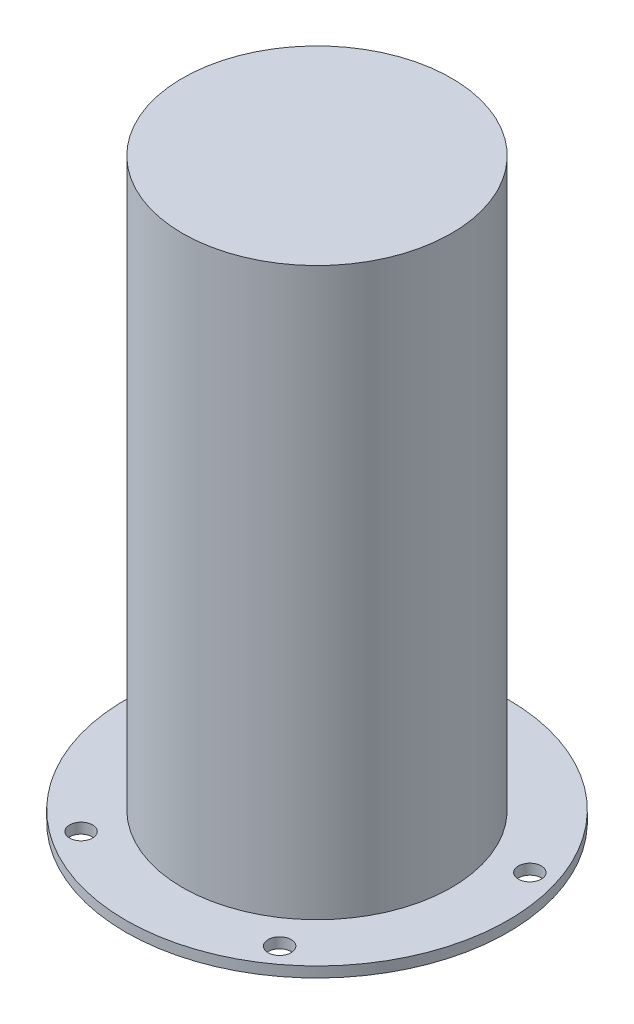
ISO-10303-21;
HEADER;
FILE_DESCRIPTION(('STEP AP214'),'2;1');
FILE_NAME('part.step','',(''),(''),'','','');
FILE_SCHEMA(('AUTOMOTIVE_DESIGN { 1 0 10303 214 1 1 1 1 }'));
ENDSEC;
DATA;
#1=APPLICATION_CONTEXT('core data for automotive mechanical design processes');
#2=APPLICATION_PROTOCOL_DEFINITION('international standard','automotive_design',2000,#1);
#3=PRODUCT_CONTEXT('',#1,'mechanical');
#4=PRODUCT('Part','Part','',(#3));
#5=PRODUCT_RELATED_PRODUCT_CATEGORY('part','',(#4));
#6=PRODUCT_DEFINITION_FORMATION('','',#4);
#7=PRODUCT_DEFINITION_CONTEXT('part definition',#1,'design');
#8=PRODUCT_DEFINITION('design','',#6,#7);
#9=PRODUCT_DEFINITION_SHAPE('','',#8);
#10=(LENGTH_UNIT() NAMED_UNIT(*) SI_UNIT(.MILLI.,.METRE.));
#11=(NAMED_UNIT(*) PLANE_ANGLE_UNIT() SI_UNIT($,.RADIAN.));
#12=(NAMED_UNIT(*) SI_UNIT($,.STERADIAN.) SOLID_ANGLE_UNIT());
#13=UNCERTAINTY_MEASURE_WITH_UNIT(LENGTH_MEASURE(1.E-05),#10,'distance_accuracy_value','');
#14=(GEOMETRIC_REPRESENTATION_CONTEXT(3) GLOBAL_UNCERTAINTY_ASSIGNED_CONTEXT((#13)) GLOBAL_UNIT_ASSIGNED_CONTEXT((#10,
#11,#12)) REPRESENTATION_CONTEXT('',''));
#15=CARTESIAN_POINT('',(0.,0.,0.));
#16=DIRECTION('',(0.,0.,1.));
#17=DIRECTION('',(1.,0.,0.));
#18=AXIS2_PLACEMENT_3D('',#15,#16,#17);
#19=CARTESIAN_POINT('',(0.,3.,0.));
#20=DIRECTION('',(0.,1.,0.));
#21=DIRECTION('',(0.,0.,1.));
#22=AXIS2_PLACEMENT_3D('',#19,#20,#21);
#23=PLANE('',#22);
#24=CARTESIAN_POINT('',(-46.2213466919445,3.,-15.0182259266224));
#25=DIRECTION('',(0.,1.,0.));
#26=DIRECTION('',(0.,0.,1.));
#27=AXIS2_PLACEMENT_3D('',#24,#25,#26);
#28=CIRCLE('',#27,3.3);
#29=CARTESIAN_POINT('',(-46.2213466919445,3.,-11.7182259266224));
#30=VERTEX_POINT('',#29);
#31=EDGE_CURVE('E65',#30,#30,#28,.T.);
#32=ORIENTED_EDGE('',*,*,#31,.F.);
#33=EDGE_LOOP('',(#32));
#34=FACE_BOUND('',#33,.T.);
#35=CARTESIAN_POINT('',(28.5663632614142,3.,39.3182259266224));
#36=DIRECTION('',(0.,1.,0.));
#37=DIRECTION('',(0.,0.,1.));
#38=AXIS2_PLACEMENT_3D('',#35,#36,#37);
#39=CIRCLE('',#38,3.29999999999999);
#40=CARTESIAN_POINT('',(28.5663632614142,3.,42.6182259266224));
#41=VERTEX_POINT('',#40);
#42=EDGE_CURVE('E77',#41,#41,#39,.T.);
#43=ORIENTED_EDGE('',*,*,#42,.F.);
#44=EDGE_LOOP('',(#43));
#45=FACE_BOUND('',#44,.T.);
#46=CARTESIAN_POINT('',(0.,3.,-48.6));
#47=DIRECTION('',(0.,1.,0.));
#48=DIRECTION('',(0.,0.,1.));
#49=AXIS2_PLACEMENT_3D('',#46,#47,#48);
#50=CIRCLE('',#49,3.3);
#51=CARTESIAN_POINT('',(0.,3.,-45.3));
#52=VERTEX_POINT('',#51);
#53=EDGE_CURVE('E89',#52,#52,#50,.T.);
#54=ORIENTED_EDGE('',*,*,#53,.F.);
#55=EDGE_LOOP('',(#54));
#56=FACE_BOUND('',#55,.T.);
#57=CARTESIAN_POINT('',(0.,3.,0.));
#58=DIRECTION('',(0.,1.,0.));
#59=DIRECTION('',(0.,0.,1.));
#60=AXIS2_PLACEMENT_3D('',#57,#58,#59);
#61=CIRCLE('',#60,55.);
#62=CARTESIAN_POINT('',(0.,3.,55.));
#63=VERTEX_POINT('',#62);
#64=EDGE_CURVE('E10',#63,#63,#61,.T.);
#65=ORIENTED_EDGE('',*,*,#64,.T.);
#66=EDGE_LOOP('',(#65));
#67=FACE_BOUND('',#66,.T.);
#68=CARTESIAN_POINT('',(46.2213466919445,3.,-15.0182259266225));
#69=DIRECTION('',(0.,1.,0.));
#70=DIRECTION('',(0.,0.,1.));
#71=AXIS2_PLACEMENT_3D('',#68,#69,#70);
#72=CIRCLE('',#71,3.3);
#73=CARTESIAN_POINT('',(46.2213466919445,3.,-11.7182259266225));
#74=VERTEX_POINT('',#73);
#75=EDGE_CURVE('E83',#74,#74,#72,.T.);
#76=ORIENTED_EDGE('',*,*,#75,.F.);
#77=EDGE_LOOP('',(#76));
#78=FACE_BOUND('',#77,.T.);
#79=CARTESIAN_POINT('',(-28.5663632614142,3.,39.3182259266225));
#80=DIRECTION('',(0.,1.,0.));
#81=DIRECTION('',(0.,0.,1.));
#82=AXIS2_PLACEMENT_3D('',#79,#80,#81);
#83=CIRCLE('',#82,3.3);
#84=CARTESIAN_POINT('',(-28.5663632614142,3.,42.6182259266225));
#85=VERTEX_POINT('',#84);
#86=EDGE_CURVE('E71',#85,#85,#83,.T.);
#87=ORIENTED_EDGE('',*,*,#86,.F.);
#88=EDGE_LOOP('',(#87));
#89=FACE_BOUND('',#88,.T.);
#90=CARTESIAN_POINT('',(0.,3.,0.));
#91=DIRECTION('',(0.,1.,0.));
#92=DIRECTION('',(0.,0.,1.));
#93=AXIS2_PLACEMENT_3D('',#90,#91,#92);
#94=CIRCLE('',#93,38.7);
#95=CARTESIAN_POINT('',(0.,3.,38.7));
#96=VERTEX_POINT('',#95);
#97=EDGE_CURVE('E50',#96,#96,#94,.T.);
#98=ORIENTED_EDGE('',*,*,#97,.F.);
#99=EDGE_LOOP('',(#98));
#100=FACE_BOUND('',#99,.T.);
#101=ADVANCED_FACE('F31',(#34,#45,#56,#67,#78,#89,#100),#23,.T.);
#102=CARTESIAN_POINT('',(0.,0.,0.));
#103=DIRECTION('',(0.,1.,0.));
#104=DIRECTION('',(0.,0.,1.));
#105=AXIS2_PLACEMENT_3D('',#102,#103,#104);
#106=PLANE('',#105);
#107=CARTESIAN_POINT('',(0.,0.,0.));
#108=DIRECTION('',(0.,1.,0.));
#109=DIRECTION('',(0.,0.,1.));
#110=AXIS2_PLACEMENT_3D('',#107,#108,#109);
#111=CIRCLE('',#110,43.4574893162176);
#112=CARTESIAN_POINT('',(0.,0.,43.4574893162176));
#113=VERTEX_POINT('',#112);
#114=EDGE_CURVE('E35',#113,#113,#111,.T.);
#115=ORIENTED_EDGE('',*,*,#114,.T.);
#116=EDGE_LOOP('',(#115));
#117=FACE_BOUND('',#116,.T.);
#118=CARTESIAN_POINT('',(-46.2213466919445,0.,-15.0182259266224));
#119=DIRECTION('',(0.,1.,0.));
#120=DIRECTION('',(0.,0.,1.));
#121=AXIS2_PLACEMENT_3D('',#118,#119,#120);
#122=CIRCLE('',#121,3.3);
#123=CARTESIAN_POINT('',(-46.2213466919445,0.,-11.7182259266224));
#124=VERTEX_POINT('',#123);
#125=EDGE_CURVE('E54',#124,#124,#122,.T.);
#126=ORIENTED_EDGE('',*,*,#125,.T.);
#127=EDGE_LOOP('',(#126));
#128=FACE_BOUND('',#127,.T.);
#129=CARTESIAN_POINT('',(28.5663632614142,0.,39.3182259266224));
#130=DIRECTION('',(0.,1.,0.));
#131=DIRECTION('',(0.,0.,1.));
#132=AXIS2_PLACEMENT_3D('',#129,#130,#131);
#133=CIRCLE('',#132,3.29999999999999);
#134=CARTESIAN_POINT('',(28.5663632614142,0.,42.6182259266224));
#135=VERTEX_POINT('',#134);
#136=EDGE_CURVE('E74',#135,#135,#133,.T.);
#137=ORIENTED_EDGE('',*,*,#136,.T.);
#138=EDGE_LOOP('',(#137));
#139=FACE_BOUND('',#138,.T.);
#140=CARTESIAN_POINT('',(0.,0.,-48.6));
#141=DIRECTION('',(0.,1.,0.));
#142=DIRECTION('',(0.,0.,1.));
#143=AXIS2_PLACEMENT_3D('',#140,#141,#142);
#144=CIRCLE('',#143,3.3);
#145=CARTESIAN_POINT('',(0.,0.,-45.3));
#146=VERTEX_POINT('',#145);
#147=EDGE_CURVE('E86',#146,#146,#144,.T.);
#148=ORIENTED_EDGE('',*,*,#147,.T.);
#149=EDGE_LOOP('',(#148));
#150=FACE_BOUND('',#149,.T.);
#151=CARTESIAN_POINT('',(0.,0.,0.));
#152=DIRECTION('',(0.,1.,0.));
#153=DIRECTION('',(0.,0.,1.));
#154=AXIS2_PLACEMENT_3D('',#151,#152,#153);
#155=CIRCLE('',#154,55.);
#156=CARTESIAN_POINT('',(0.,0.,55.));
#157=VERTEX_POINT('',#156);
#158=EDGE_CURVE('E39',#157,#157,#155,.T.);
#159=ORIENTED_EDGE('',*,*,#158,.F.);
#160=EDGE_LOOP('',(#159));
#161=FACE_BOUND('',#160,.T.);
#162=CARTESIAN_POINT('',(46.2213466919445,0.,-15.0182259266225));
#163=DIRECTION('',(0.,1.,0.));
#164=DIRECTION('',(0.,0.,1.));
#165=AXIS2_PLACEMENT_3D('',#162,#163,#164);
#166=CIRCLE('',#165,3.3);
#167=CARTESIAN_POINT('',(46.2213466919445,0.,-11.7182259266225));
#168=VERTEX_POINT('',#167);
#169=EDGE_CURVE('E80',#168,#168,#166,.T.);
#170=ORIENTED_EDGE('',*,*,#169,.T.);
#171=EDGE_LOOP('',(#170));
#172=FACE_BOUND('',#171,.T.);
#173=CARTESIAN_POINT('',(-28.5663632614142,0.,39.3182259266225));
#174=DIRECTION('',(0.,1.,0.));
#175=DIRECTION('',(0.,0.,1.));
#176=AXIS2_PLACEMENT_3D('',#173,#174,#175);
#177=CIRCLE('',#176,3.3);
#178=CARTESIAN_POINT('',(-28.5663632614142,0.,42.6182259266225));
#179=VERTEX_POINT('',#178);
#180=EDGE_CURVE('E68',#179,#179,#177,.T.);
#181=ORIENTED_EDGE('',*,*,#180,.T.);
#182=EDGE_LOOP('',(#181));
#183=FACE_BOUND('',#182,.T.);
#184=ADVANCED_FACE('F94',(#117,#128,#139,#150,#161,#172,#183),#106,.F.);
#185=CARTESIAN_POINT('',(0.,0.,0.));
#186=DIRECTION('',(0.,-1.,0.));
#187=DIRECTION('',(0.,0.,-1.));
#188=AXIS2_PLACEMENT_3D('',#185,#186,#187);
#189=CIRCLE('',#188,38.1925106837824);
#190=CARTESIAN_POINT('',(0.,0.,-38.1925106837824));
#191=VERTEX_POINT('',#190);
#192=EDGE_CURVE('E48',#191,#191,#189,.T.);
#193=ORIENTED_EDGE('',*,*,#192,.T.);
#194=EDGE_LOOP('',(#193));
#195=FACE_BOUND('',#194,.T.);
#196=CARTESIAN_POINT('',(0.,0.,0.));
#197=DIRECTION('',(0.,1.,0.));
#198=DIRECTION('',(0.,0.,1.));
#199=AXIS2_PLACEMENT_3D('',#196,#197,#198);
#200=CIRCLE('',#199,37.5);
#201=CARTESIAN_POINT('',(0.,0.,37.5));
#202=VERTEX_POINT('',#201);
#203=EDGE_CURVE('E44',#202,#202,#200,.T.);
#204=ORIENTED_EDGE('',*,*,#203,.T.);
#205=EDGE_LOOP('',(#204));
#206=FACE_BOUND('',#205,.T.);
#207=ADVANCED_FACE('F121',(#195,#206),#106,.F.);
#208=CARTESIAN_POINT('',(0.,3.,0.));
#209=DIRECTION('',(0.,-1.,0.));
#210=DIRECTION('',(0.,0.,-1.));
#211=AXIS2_PLACEMENT_3D('',#208,#209,#210);
#212=CYLINDRICAL_SURFACE('',#211,55.);
#213=ORIENTED_EDGE('',*,*,#64,.F.);
#214=EDGE_LOOP('',(#213));
#215=FACE_BOUND('',#214,.T.);
#216=ORIENTED_EDGE('',*,*,#158,.T.);
#217=EDGE_LOOP('',(#216));
#218=FACE_BOUND('',#217,.T.);
#219=ADVANCED_FACE('F33',(#215,#218),#212,.T.);
#220=CARTESIAN_POINT('',(0.,3.,0.));
#221=DIRECTION('',(0.,-1.,0.));
#222=DIRECTION('',(0.,0.,-1.));
#223=AXIS2_PLACEMENT_3D('',#220,#221,#222);
#224=CYLINDRICAL_SURFACE('',#223,37.5);
#225=ORIENTED_EDGE('',*,*,#203,.F.);
#226=EDGE_LOOP('',(#225));
#227=FACE_BOUND('',#226,.T.);
#228=CARTESIAN_POINT('',(0.,163.,0.));
#229=DIRECTION('',(0.,1.,0.));
#230=DIRECTION('',(0.,0.,1.));
#231=AXIS2_PLACEMENT_3D('',#228,#229,#230);
#232=CIRCLE('',#231,37.5);
#233=CARTESIAN_POINT('',(0.,163.,37.5));
#234=VERTEX_POINT('',#233);
#235=EDGE_CURVE('E56',#234,#234,#232,.T.);
#236=ORIENTED_EDGE('',*,*,#235,.T.);
#237=EDGE_LOOP('',(#236));
#238=FACE_BOUND('',#237,.T.);
#239=ADVANCED_FACE('F100',(#227,#238),#224,.F.);
#240=CARTESIAN_POINT('',(0.,3.,-48.6));
#241=DIRECTION('',(0.,-1.,0.));
#242=DIRECTION('',(0.,0.,-1.));
#243=AXIS2_PLACEMENT_3D('',#240,#241,#242);
#244=CYLINDRICAL_SURFACE('',#243,3.3);
#245=ORIENTED_EDGE('',*,*,#53,.T.);
#246=EDGE_LOOP('',(#245));
#247=FACE_BOUND('',#246,.T.);
#248=ORIENTED_EDGE('',*,*,#147,.F.);
#249=EDGE_LOOP('',(#248));
#250=FACE_BOUND('',#249,.T.);
#251=ADVANCED_FACE('F97',(#247,#250),#244,.F.);
#252=CARTESIAN_POINT('',(46.2213466919445,3.,-15.0182259266225));
#253=DIRECTION('',(0.,-1.,0.));
#254=DIRECTION('',(0.,0.,-1.));
#255=AXIS2_PLACEMENT_3D('',#252,#253,#254);
#256=CYLINDRICAL_SURFACE('',#255,3.3);
#257=ORIENTED_EDGE('',*,*,#75,.T.);
#258=EDGE_LOOP('',(#257));
#259=FACE_BOUND('',#258,.T.);
#260=ORIENTED_EDGE('',*,*,#169,.F.);
#261=EDGE_LOOP('',(#260));
#262=FACE_BOUND('',#261,.T.);
#263=ADVANCED_FACE('F99',(#259,#262),#256,.F.);
#264=CARTESIAN_POINT('',(28.5663632614142,3.,39.3182259266224));
#265=DIRECTION('',(0.,-1.,0.));
#266=DIRECTION('',(0.,0.,-1.));
#267=AXIS2_PLACEMENT_3D('',#264,#265,#266);
#268=CYLINDRICAL_SURFACE('',#267,3.29999999999999);
#269=ORIENTED_EDGE('',*,*,#42,.T.);
#270=EDGE_LOOP('',(#269));
#271=FACE_BOUND('',#270,.T.);
#272=ORIENTED_EDGE('',*,*,#136,.F.);
#273=EDGE_LOOP('',(#272));
#274=FACE_BOUND('',#273,.T.);
#275=ADVANCED_FACE('F107',(#271,#274),#268,.F.);
#276=CARTESIAN_POINT('',(-28.5663632614142,3.,39.3182259266225));
#277=DIRECTION('',(0.,-1.,0.));
#278=DIRECTION('',(0.,0.,-1.));
#279=AXIS2_PLACEMENT_3D('',#276,#277,#278);
#280=CYLINDRICAL_SURFACE('',#279,3.3);
#281=ORIENTED_EDGE('',*,*,#86,.T.);
#282=EDGE_LOOP('',(#281));
#283=FACE_BOUND('',#282,.T.);
#284=ORIENTED_EDGE('',*,*,#180,.F.);
#285=EDGE_LOOP('',(#284));
#286=FACE_BOUND('',#285,.T.);
#287=ADVANCED_FACE('F155',(#283,#286),#280,.F.);
#288=CARTESIAN_POINT('',(-46.2213466919445,3.,-15.0182259266224));
#289=DIRECTION('',(0.,-1.,0.));
#290=DIRECTION('',(0.,0.,-1.));
#291=AXIS2_PLACEMENT_3D('',#288,#289,#290);
#292=CYLINDRICAL_SURFACE('',#291,3.3);
#293=ORIENTED_EDGE('',*,*,#31,.T.);
#294=EDGE_LOOP('',(#293));
#295=FACE_BOUND('',#294,.T.);
#296=ORIENTED_EDGE('',*,*,#125,.F.);
#297=EDGE_LOOP('',(#296));
#298=FACE_BOUND('',#297,.T.);
#299=ADVANCED_FACE('F151',(#295,#298),#292,.F.);
#300=CARTESIAN_POINT('',(0.,-1.775,0.));
#301=DIRECTION('',(0.,-1.,0.));
#302=DIRECTION('',(0.,0.,-1.));
#303=AXIS2_PLACEMENT_3D('',#300,#301,#302);
#304=TOROIDAL_SURFACE('',#303,40.825,3.175);
#305=ORIENTED_EDGE('',*,*,#192,.F.);
#306=EDGE_LOOP('',(#305));
#307=FACE_BOUND('',#306,.T.);
#308=ORIENTED_EDGE('',*,*,#114,.F.);
#309=EDGE_LOOP('',(#308));
#310=FACE_BOUND('',#309,.T.);
#311=ADVANCED_FACE('F148',(#307,#310),#304,.F.);
#312=CARTESIAN_POINT('',(0.,163.,0.));
#313=DIRECTION('',(0.,-1.,0.));
#314=DIRECTION('',(0.,0.,-1.));
#315=AXIS2_PLACEMENT_3D('',#312,#313,#314);
#316=CYLINDRICAL_SURFACE('',#315,38.7);
#317=ORIENTED_EDGE('',*,*,#97,.T.);
#318=EDGE_LOOP('',(#317));
#319=FACE_BOUND('',#318,.T.);
#320=CARTESIAN_POINT('',(0.,166.,0.));
#321=DIRECTION('',(0.,1.,0.));
#322=DIRECTION('',(0.,0.,1.));
#323=AXIS2_PLACEMENT_3D('',#320,#321,#322);
#324=CIRCLE('',#323,38.7);
#325=CARTESIAN_POINT('',(0.,166.,38.7));
#326=VERTEX_POINT('',#325);
#327=EDGE_CURVE('E61',#326,#326,#324,.T.);
#328=ORIENTED_EDGE('',*,*,#327,.F.);
#329=EDGE_LOOP('',(#328));
#330=FACE_BOUND('',#329,.T.);
#331=ADVANCED_FACE('F142',(#319,#330),#316,.T.);
#332=CARTESIAN_POINT('',(0.,166.,0.));
#333=DIRECTION('',(0.,1.,0.));
#334=DIRECTION('',(0.,0.,1.));
#335=AXIS2_PLACEMENT_3D('',#332,#333,#334);
#336=PLANE('',#335);
#337=ORIENTED_EDGE('',*,*,#327,.T.);
#338=EDGE_LOOP('',(#337));
#339=FACE_BOUND('',#338,.T.);
#340=ADVANCED_FACE('F137',(#339),#336,.T.);
#341=CARTESIAN_POINT('',(0.,163.,0.));
#342=DIRECTION('',(0.,1.,0.));
#343=DIRECTION('',(0.,0.,1.));
#344=AXIS2_PLACEMENT_3D('',#341,#342,#343);
#345=PLANE('',#344);
#346=ORIENTED_EDGE('',*,*,#235,.F.);
#347=EDGE_LOOP('',(#346));
#348=FACE_BOUND('',#347,.T.);
#349=ADVANCED_FACE('F135',(#348),#345,.F.);
#350=CLOSED_SHELL('',(#101,#184,#207,#219,#239,#251,#263,#275,#287,#299,#311,#331,#340,#349));
#351=MANIFOLD_SOLID_BREP('B2',#350);
#352=ADVANCED_BREP_SHAPE_REPRESENTATION('',(#18,#351),#14);
#353=SHAPE_DEFINITION_REPRESENTATION(#9,#352);
ENDSEC;
END-ISO-10303-21;
